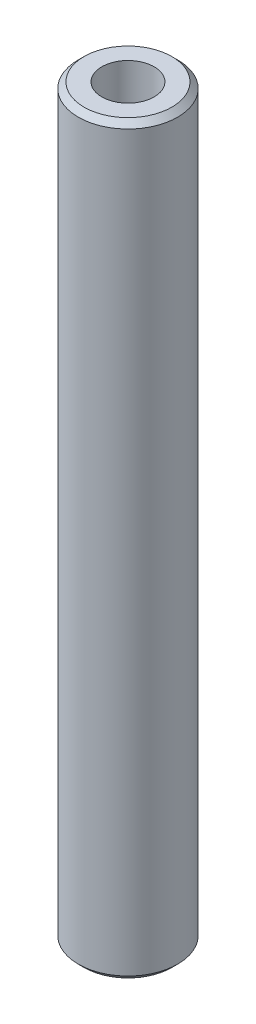
ISO-10303-21;
HEADER;
FILE_DESCRIPTION(('STEP AP214'),'2;1');
FILE_NAME('part.step','',(''),(''),'','','');
FILE_SCHEMA(('AUTOMOTIVE_DESIGN { 1 0 10303 214 1 1 1 1 }'));
ENDSEC;
DATA;
#1=APPLICATION_CONTEXT('core data for automotive mechanical design processes');
#2=APPLICATION_PROTOCOL_DEFINITION('international standard','automotive_design',2000,#1);
#3=PRODUCT_CONTEXT('',#1,'mechanical');
#4=PRODUCT('Part','Part','',(#3));
#5=PRODUCT_RELATED_PRODUCT_CATEGORY('part','',(#4));
#6=PRODUCT_DEFINITION_FORMATION('','',#4);
#7=PRODUCT_DEFINITION_CONTEXT('part definition',#1,'design');
#8=PRODUCT_DEFINITION('design','',#6,#7);
#9=PRODUCT_DEFINITION_SHAPE('','',#8);
#10=(LENGTH_UNIT() NAMED_UNIT(*) SI_UNIT(.MILLI.,.METRE.));
#11=(NAMED_UNIT(*) PLANE_ANGLE_UNIT() SI_UNIT($,.RADIAN.));
#12=(NAMED_UNIT(*) SI_UNIT($,.STERADIAN.) SOLID_ANGLE_UNIT());
#13=UNCERTAINTY_MEASURE_WITH_UNIT(LENGTH_MEASURE(1.E-05),#10,'distance_accuracy_value','');
#14=(GEOMETRIC_REPRESENTATION_CONTEXT(3) GLOBAL_UNCERTAINTY_ASSIGNED_CONTEXT((#13)) GLOBAL_UNIT_ASSIGNED_CONTEXT((#10,
#11,#12)) REPRESENTATION_CONTEXT('',''));
#15=CARTESIAN_POINT('',(0.,0.,0.));
#16=DIRECTION('',(0.,0.,1.));
#17=DIRECTION('',(1.,0.,0.));
#18=AXIS2_PLACEMENT_3D('',#15,#16,#17);
#19=CARTESIAN_POINT('',(0.,600.,0.));
#20=DIRECTION('',(0.,-1.,0.));
#21=DIRECTION('',(0.,0.,-1.));
#22=AXIS2_PLACEMENT_3D('',#19,#20,#21);
#23=CYLINDRICAL_SURFACE('',#22,40.);
#24=CARTESIAN_POINT('',(0.,595.339728365766,0.));
#25=DIRECTION('',(0.,1.,0.));
#26=DIRECTION('',(0.,0.,1.));
#27=AXIS2_PLACEMENT_3D('',#24,#25,#26);
#28=CIRCLE('',#27,40.);
#29=CARTESIAN_POINT('',(0.,595.339728365766,40.));
#30=VERTEX_POINT('',#29);
#31=EDGE_CURVE('E50',#30,#30,#28,.F.);
#32=ORIENTED_EDGE('',*,*,#31,.T.);
#33=EDGE_LOOP('',(#32));
#34=FACE_BOUND('',#33,.T.);
#35=CARTESIAN_POINT('',(0.,4.66027163423344,0.));
#36=DIRECTION('',(0.,1.,0.));
#37=DIRECTION('',(0.,0.,1.));
#38=AXIS2_PLACEMENT_3D('',#35,#36,#37);
#39=CIRCLE('',#38,40.);
#40=CARTESIAN_POINT('',(0.,4.66027163423344,40.));
#41=VERTEX_POINT('',#40);
#42=EDGE_CURVE('E51',#41,#41,#39,.T.);
#43=ORIENTED_EDGE('',*,*,#42,.T.);
#44=EDGE_LOOP('',(#43));
#45=FACE_BOUND('',#44,.T.);
#46=ADVANCED_FACE('F39',(#34,#45),#23,.T.);
#47=CARTESIAN_POINT('',(0.,600.,0.));
#48=DIRECTION('',(0.,1.,0.));
#49=DIRECTION('',(0.,0.,1.));
#50=AXIS2_PLACEMENT_3D('',#47,#48,#49);
#51=PLANE('',#50);
#52=CARTESIAN_POINT('',(0.,600.,0.));
#53=DIRECTION('',(0.,1.,0.));
#54=DIRECTION('',(0.,0.,1.));
#55=AXIS2_PLACEMENT_3D('',#52,#53,#54);
#56=CIRCLE('',#55,35.3397283657664);
#57=CARTESIAN_POINT('',(0.,600.,35.3397283657664));
#58=VERTEX_POINT('',#57);
#59=EDGE_CURVE('E54',#58,#58,#56,.T.);
#60=ORIENTED_EDGE('',*,*,#59,.T.);
#61=EDGE_LOOP('',(#60));
#62=FACE_BOUND('',#61,.T.);
#63=CARTESIAN_POINT('',(0.,600.,0.));
#64=DIRECTION('',(0.,1.,0.));
#65=DIRECTION('',(0.,0.,1.));
#66=AXIS2_PLACEMENT_3D('',#63,#64,#65);
#67=CIRCLE('',#66,21.0634384800146);
#68=CARTESIAN_POINT('',(0.,600.,21.0634384800146));
#69=VERTEX_POINT('',#68);
#70=EDGE_CURVE('E58',#69,#69,#67,.T.);
#71=ORIENTED_EDGE('',*,*,#70,.F.);
#72=EDGE_LOOP('',(#71));
#73=FACE_BOUND('',#72,.T.);
#74=ADVANCED_FACE('F69',(#62,#73),#51,.T.);
#75=CARTESIAN_POINT('',(0.,0.,0.));
#76=DIRECTION('',(0.,1.,0.));
#77=DIRECTION('',(0.,0.,1.));
#78=AXIS2_PLACEMENT_3D('',#75,#76,#77);
#79=PLANE('',#78);
#80=CARTESIAN_POINT('',(0.,0.,0.));
#81=DIRECTION('',(0.,1.,0.));
#82=DIRECTION('',(0.,0.,1.));
#83=AXIS2_PLACEMENT_3D('',#80,#81,#82);
#84=CIRCLE('',#83,35.3397283657665);
#85=CARTESIAN_POINT('',(0.,0.,35.3397283657665));
#86=VERTEX_POINT('',#85);
#87=EDGE_CURVE('E10',#86,#86,#84,.F.);
#88=ORIENTED_EDGE('',*,*,#87,.T.);
#89=EDGE_LOOP('',(#88));
#90=FACE_BOUND('',#89,.T.);
#91=CARTESIAN_POINT('',(0.,0.,0.));
#92=DIRECTION('',(0.,1.,0.));
#93=DIRECTION('',(0.,0.,1.));
#94=AXIS2_PLACEMENT_3D('',#91,#92,#93);
#95=CIRCLE('',#94,21.0634384800146);
#96=CARTESIAN_POINT('',(0.,0.,21.0634384800146));
#97=VERTEX_POINT('',#96);
#98=EDGE_CURVE('E63',#97,#97,#95,.T.);
#99=ORIENTED_EDGE('',*,*,#98,.T.);
#100=EDGE_LOOP('',(#99));
#101=FACE_BOUND('',#100,.T.);
#102=ADVANCED_FACE('F75',(#90,#101),#79,.F.);
#103=CARTESIAN_POINT('',(0.,600.,0.));
#104=DIRECTION('',(0.,-1.,0.));
#105=DIRECTION('',(0.,0.,-1.));
#106=AXIS2_PLACEMENT_3D('',#103,#104,#105);
#107=CYLINDRICAL_SURFACE('',#106,21.0634384800146);
#108=ORIENTED_EDGE('',*,*,#70,.T.);
#109=EDGE_LOOP('',(#108));
#110=FACE_BOUND('',#109,.T.);
#111=ORIENTED_EDGE('',*,*,#98,.F.);
#112=EDGE_LOOP('',(#111));
#113=FACE_BOUND('',#112,.T.);
#114=ADVANCED_FACE('F70',(#110,#113),#107,.F.);
#115=CARTESIAN_POINT('',(0.,600.,0.));
#116=DIRECTION('',(0.,-1.,0.));
#117=DIRECTION('',(0.,0.,-1.));
#118=AXIS2_PLACEMENT_3D('',#115,#116,#117);
#119=CONICAL_SURFACE('',#118,35.3397283657664,0.785398163397433);
#120=ORIENTED_EDGE('',*,*,#31,.F.);
#121=EDGE_LOOP('',(#120));
#122=FACE_BOUND('',#121,.T.);
#123=ORIENTED_EDGE('',*,*,#59,.F.);
#124=EDGE_LOOP('',(#123));
#125=FACE_BOUND('',#124,.T.);
#126=ADVANCED_FACE('F81',(#122,#125),#119,.T.);
#127=CARTESIAN_POINT('',(0.,4.66027163423344,0.));
#128=DIRECTION('',(0.,1.,0.));
#129=DIRECTION('',(0.,0.,1.));
#130=AXIS2_PLACEMENT_3D('',#127,#128,#129);
#131=CONICAL_SURFACE('',#130,40.,0.78539816339745);
#132=ORIENTED_EDGE('',*,*,#87,.F.);
#133=EDGE_LOOP('',(#132));
#134=FACE_BOUND('',#133,.T.);
#135=ORIENTED_EDGE('',*,*,#42,.F.);
#136=EDGE_LOOP('',(#135));
#137=FACE_BOUND('',#136,.T.);
#138=ADVANCED_FACE('F45',(#134,#137),#131,.T.);
#139=CLOSED_SHELL('',(#46,#74,#102,#114,#126,#138));
#140=MANIFOLD_SOLID_BREP('B2',#139);
#141=ADVANCED_BREP_SHAPE_REPRESENTATION('',(#18,#140),#14);
#142=SHAPE_DEFINITION_REPRESENTATION(#9,#141);
ENDSEC;
END-ISO-10303-21;
